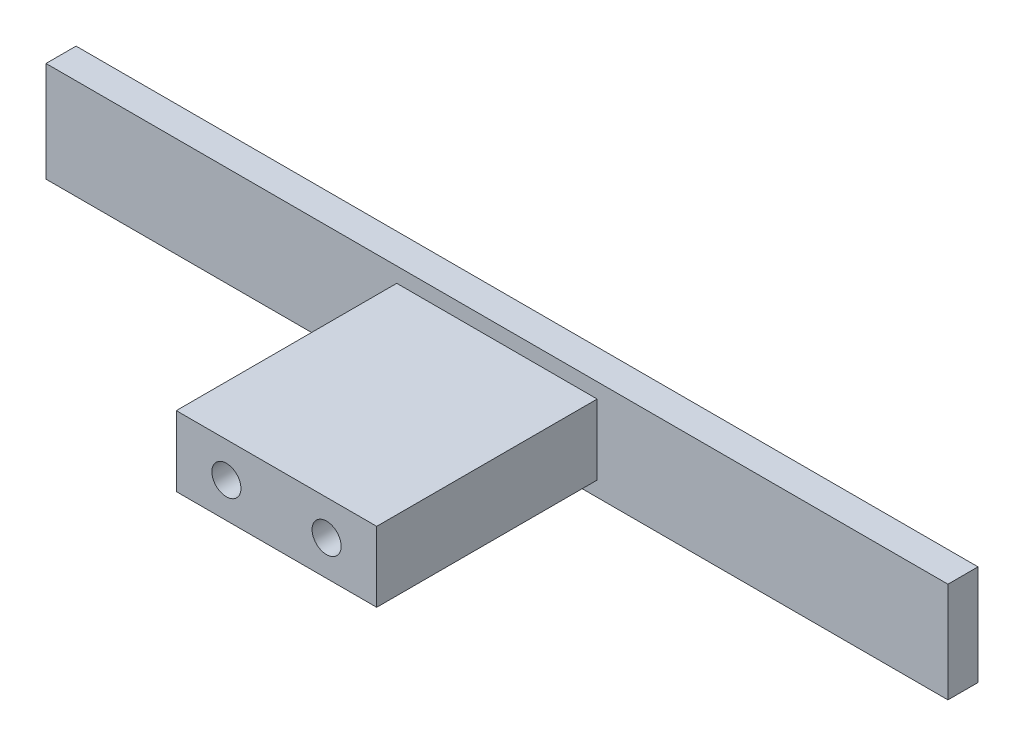
ISO-10303-21;
HEADER;
FILE_DESCRIPTION(('STEP AP214'),'2;1');
FILE_NAME('part.step','',(''),(''),'','','');
FILE_SCHEMA(('AUTOMOTIVE_DESIGN { 1 0 10303 214 1 1 1 1 }'));
ENDSEC;
DATA;
#1=APPLICATION_CONTEXT('core data for automotive mechanical design processes');
#2=APPLICATION_PROTOCOL_DEFINITION('international standard','automotive_design',2000,#1);
#3=PRODUCT_CONTEXT('',#1,'mechanical');
#4=PRODUCT('Part','Part','',(#3));
#5=PRODUCT_RELATED_PRODUCT_CATEGORY('part','',(#4));
#6=PRODUCT_DEFINITION_FORMATION('','',#4);
#7=PRODUCT_DEFINITION_CONTEXT('part definition',#1,'design');
#8=PRODUCT_DEFINITION('design','',#6,#7);
#9=PRODUCT_DEFINITION_SHAPE('','',#8);
#10=(LENGTH_UNIT() NAMED_UNIT(*) SI_UNIT(.MILLI.,.METRE.));
#11=(NAMED_UNIT(*) PLANE_ANGLE_UNIT() SI_UNIT($,.RADIAN.));
#12=(NAMED_UNIT(*) SI_UNIT($,.STERADIAN.) SOLID_ANGLE_UNIT());
#13=UNCERTAINTY_MEASURE_WITH_UNIT(LENGTH_MEASURE(1.E-05),#10,'distance_accuracy_value','');
#14=(GEOMETRIC_REPRESENTATION_CONTEXT(3) GLOBAL_UNCERTAINTY_ASSIGNED_CONTEXT((#13)) GLOBAL_UNIT_ASSIGNED_CONTEXT((#10,
#11,#12)) REPRESENTATION_CONTEXT('',''));
#15=CARTESIAN_POINT('',(0.,0.,0.));
#16=DIRECTION('',(0.,0.,1.));
#17=DIRECTION('',(1.,0.,0.));
#18=AXIS2_PLACEMENT_3D('',#15,#16,#17);
#19=CARTESIAN_POINT('',(0.,0.,3.));
#20=DIRECTION('',(1.,0.,0.));
#21=DIRECTION('',(0.,0.,-1.));
#22=AXIS2_PLACEMENT_3D('',#19,#20,#21);
#23=PLANE('',#22);
#24=DIRECTION('',(0.,-1.,0.));
#25=VECTOR('',#24,1.);
#26=CARTESIAN_POINT('',(0.,0.,0.));
#27=LINE('',#26,#25);
#28=CARTESIAN_POINT('',(0.,10.,0.));
#29=VERTEX_POINT('',#28);
#30=CARTESIAN_POINT('',(0.,0.,0.));
#31=VERTEX_POINT('',#30);
#32=EDGE_CURVE('E150',#29,#31,#27,.T.);
#33=ORIENTED_EDGE('',*,*,#32,.T.);
#34=DIRECTION('',(0.,0.,-1.));
#35=VECTOR('',#34,1.);
#36=CARTESIAN_POINT('',(0.,0.,3.));
#37=LINE('',#36,#35);
#38=CARTESIAN_POINT('',(0.,0.,3.));
#39=VERTEX_POINT('',#38);
#40=EDGE_CURVE('E11',#39,#31,#37,.T.);
#41=ORIENTED_EDGE('',*,*,#40,.F.);
#42=DIRECTION('',(0.,-1.,0.));
#43=VECTOR('',#42,1.);
#44=CARTESIAN_POINT('',(0.,0.,3.));
#45=LINE('',#44,#43);
#46=CARTESIAN_POINT('',(0.,10.,3.));
#47=VERTEX_POINT('',#46);
#48=EDGE_CURVE('E157',#47,#39,#45,.T.);
#49=ORIENTED_EDGE('',*,*,#48,.F.);
#50=DIRECTION('',(0.,0.,-1.));
#51=VECTOR('',#50,1.);
#52=CARTESIAN_POINT('',(0.,10.,3.));
#53=LINE('',#52,#51);
#54=EDGE_CURVE('E171',#47,#29,#53,.T.);
#55=ORIENTED_EDGE('',*,*,#54,.T.);
#56=EDGE_LOOP('',(#33,#41,#49,#55));
#57=FACE_BOUND('',#56,.T.);
#58=ADVANCED_FACE('F39',(#57),#23,.F.);
#59=CARTESIAN_POINT('',(0.,0.,3.));
#60=DIRECTION('',(0.,1.,0.));
#61=DIRECTION('',(0.,0.,1.));
#62=AXIS2_PLACEMENT_3D('',#59,#60,#61);
#63=PLANE('',#62);
#64=DIRECTION('',(1.,0.,0.));
#65=VECTOR('',#64,1.);
#66=CARTESIAN_POINT('',(0.,0.,0.));
#67=LINE('',#66,#65);
#68=CARTESIAN_POINT('',(90.,0.,0.));
#69=VERTEX_POINT('',#68);
#70=EDGE_CURVE('E175',#31,#69,#67,.T.);
#71=ORIENTED_EDGE('',*,*,#70,.T.);
#72=DIRECTION('',(0.,0.,-1.));
#73=VECTOR('',#72,1.);
#74=CARTESIAN_POINT('',(90.,0.,3.));
#75=LINE('',#74,#73);
#76=CARTESIAN_POINT('',(90.,0.,3.));
#77=VERTEX_POINT('',#76);
#78=EDGE_CURVE('E47',#77,#69,#75,.T.);
#79=ORIENTED_EDGE('',*,*,#78,.F.);
#80=DIRECTION('',(1.,0.,0.));
#81=VECTOR('',#80,1.);
#82=CARTESIAN_POINT('',(0.,0.,3.));
#83=LINE('',#82,#81);
#84=EDGE_CURVE('E161',#39,#77,#83,.T.);
#85=ORIENTED_EDGE('',*,*,#84,.F.);
#86=ORIENTED_EDGE('',*,*,#40,.T.);
#87=EDGE_LOOP('',(#71,#79,#85,#86));
#88=FACE_BOUND('',#87,.T.);
#89=ADVANCED_FACE('F211',(#88),#63,.F.);
#90=CARTESIAN_POINT('',(90.,0.,3.));
#91=DIRECTION('',(-1.,0.,0.));
#92=DIRECTION('',(0.,0.,1.));
#93=AXIS2_PLACEMENT_3D('',#90,#91,#92);
#94=PLANE('',#93);
#95=DIRECTION('',(0.,1.,0.));
#96=VECTOR('',#95,1.);
#97=CARTESIAN_POINT('',(90.,0.,0.));
#98=LINE('',#97,#96);
#99=CARTESIAN_POINT('',(90.,10.,0.));
#100=VERTEX_POINT('',#99);
#101=EDGE_CURVE('E178',#69,#100,#98,.T.);
#102=ORIENTED_EDGE('',*,*,#101,.T.);
#103=DIRECTION('',(0.,0.,-1.));
#104=VECTOR('',#103,1.);
#105=CARTESIAN_POINT('',(90.,10.,3.));
#106=LINE('',#105,#104);
#107=CARTESIAN_POINT('',(90.,10.,3.));
#108=VERTEX_POINT('',#107);
#109=EDGE_CURVE('E186',#108,#100,#106,.T.);
#110=ORIENTED_EDGE('',*,*,#109,.F.);
#111=DIRECTION('',(0.,1.,0.));
#112=VECTOR('',#111,1.);
#113=CARTESIAN_POINT('',(90.,0.,3.));
#114=LINE('',#113,#112);
#115=EDGE_CURVE('E165',#77,#108,#114,.T.);
#116=ORIENTED_EDGE('',*,*,#115,.F.);
#117=ORIENTED_EDGE('',*,*,#78,.T.);
#118=EDGE_LOOP('',(#102,#110,#116,#117));
#119=FACE_BOUND('',#118,.T.);
#120=ADVANCED_FACE('F195',(#119),#94,.F.);
#121=CARTESIAN_POINT('',(0.,10.,3.));
#122=DIRECTION('',(0.,-1.,0.));
#123=DIRECTION('',(0.,0.,-1.));
#124=AXIS2_PLACEMENT_3D('',#121,#122,#123);
#125=PLANE('',#124);
#126=DIRECTION('',(-1.,0.,0.));
#127=VECTOR('',#126,1.);
#128=CARTESIAN_POINT('',(0.,10.,0.));
#129=LINE('',#128,#127);
#130=EDGE_CURVE('E162',#100,#29,#129,.T.);
#131=ORIENTED_EDGE('',*,*,#130,.T.);
#132=ORIENTED_EDGE('',*,*,#54,.F.);
#133=DIRECTION('',(-1.,0.,0.));
#134=VECTOR('',#133,1.);
#135=CARTESIAN_POINT('',(0.,10.,3.));
#136=LINE('',#135,#134);
#137=EDGE_CURVE('E168',#108,#47,#136,.T.);
#138=ORIENTED_EDGE('',*,*,#137,.F.);
#139=ORIENTED_EDGE('',*,*,#109,.T.);
#140=EDGE_LOOP('',(#131,#132,#138,#139));
#141=FACE_BOUND('',#140,.T.);
#142=ADVANCED_FACE('F204',(#141),#125,.F.);
#143=CARTESIAN_POINT('',(0.,0.,3.));
#144=DIRECTION('',(0.,0.,-1.));
#145=DIRECTION('',(-1.,0.,0.));
#146=AXIS2_PLACEMENT_3D('',#143,#144,#145);
#147=PLANE('',#146);
#148=DIRECTION('',(1.,0.,0.));
#149=VECTOR('',#148,1.);
#150=CARTESIAN_POINT('',(35.,1.5,3.));
#151=LINE('',#150,#149);
#152=CARTESIAN_POINT('',(35.,1.5,3.));
#153=VERTEX_POINT('',#152);
#154=CARTESIAN_POINT('',(55.,1.5,3.));
#155=VERTEX_POINT('',#154);
#156=EDGE_CURVE('E126',#153,#155,#151,.T.);
#157=ORIENTED_EDGE('',*,*,#156,.F.);
#158=DIRECTION('',(0.,1.,0.));
#159=VECTOR('',#158,1.);
#160=CARTESIAN_POINT('',(35.,1.5,3.));
#161=LINE('',#160,#159);
#162=CARTESIAN_POINT('',(35.,8.5,3.));
#163=VERTEX_POINT('',#162);
#164=EDGE_CURVE('E54',#153,#163,#161,.T.);
#165=ORIENTED_EDGE('',*,*,#164,.T.);
#166=DIRECTION('',(1.,0.,0.));
#167=VECTOR('',#166,1.);
#168=CARTESIAN_POINT('',(35.,8.5,3.));
#169=LINE('',#168,#167);
#170=CARTESIAN_POINT('',(55.,8.5,3.));
#171=VERTEX_POINT('',#170);
#172=EDGE_CURVE('E59',#163,#171,#169,.T.);
#173=ORIENTED_EDGE('',*,*,#172,.T.);
#174=DIRECTION('',(0.,1.,0.));
#175=VECTOR('',#174,1.);
#176=CARTESIAN_POINT('',(55.,1.5,3.));
#177=LINE('',#176,#175);
#178=EDGE_CURVE('E130',#155,#171,#177,.T.);
#179=ORIENTED_EDGE('',*,*,#178,.F.);
#180=EDGE_LOOP('',(#157,#165,#173,#179));
#181=FACE_BOUND('',#180,.T.);
#182=ORIENTED_EDGE('',*,*,#48,.T.);
#183=ORIENTED_EDGE('',*,*,#84,.T.);
#184=ORIENTED_EDGE('',*,*,#115,.T.);
#185=ORIENTED_EDGE('',*,*,#137,.T.);
#186=EDGE_LOOP('',(#182,#183,#184,#185));
#187=FACE_BOUND('',#186,.T.);
#188=ADVANCED_FACE('F210',(#181,#187),#147,.F.);
#189=CARTESIAN_POINT('',(0.,0.,0.));
#190=DIRECTION('',(0.,0.,-1.));
#191=DIRECTION('',(-1.,0.,0.));
#192=AXIS2_PLACEMENT_3D('',#189,#190,#191);
#193=PLANE('',#192);
#194=ORIENTED_EDGE('',*,*,#32,.F.);
#195=ORIENTED_EDGE('',*,*,#130,.F.);
#196=ORIENTED_EDGE('',*,*,#101,.F.);
#197=ORIENTED_EDGE('',*,*,#70,.F.);
#198=EDGE_LOOP('',(#194,#195,#196,#197));
#199=FACE_BOUND('',#198,.T.);
#200=ADVANCED_FACE('F201',(#199),#193,.T.);
#201=CARTESIAN_POINT('',(35.,1.5,25.));
#202=DIRECTION('',(-1.,0.,0.));
#203=DIRECTION('',(0.,0.,1.));
#204=AXIS2_PLACEMENT_3D('',#201,#202,#203);
#205=PLANE('',#204);
#206=ORIENTED_EDGE('',*,*,#164,.F.);
#207=DIRECTION('',(0.,0.,-1.));
#208=VECTOR('',#207,1.);
#209=CARTESIAN_POINT('',(35.,1.5,25.));
#210=LINE('',#209,#208);
#211=CARTESIAN_POINT('',(35.,1.5,25.));
#212=VERTEX_POINT('',#211);
#213=EDGE_CURVE('E123',#212,#153,#210,.T.);
#214=ORIENTED_EDGE('',*,*,#213,.F.);
#215=DIRECTION('',(0.,1.,0.));
#216=VECTOR('',#215,1.);
#217=CARTESIAN_POINT('',(35.,1.5,25.));
#218=LINE('',#217,#216);
#219=CARTESIAN_POINT('',(35.,8.5,25.));
#220=VERTEX_POINT('',#219);
#221=EDGE_CURVE('E115',#212,#220,#218,.T.);
#222=ORIENTED_EDGE('',*,*,#221,.T.);
#223=DIRECTION('',(0.,0.,-1.));
#224=VECTOR('',#223,1.);
#225=CARTESIAN_POINT('',(35.,8.5,25.));
#226=LINE('',#225,#224);
#227=EDGE_CURVE('E102',#220,#163,#226,.T.);
#228=ORIENTED_EDGE('',*,*,#227,.T.);
#229=EDGE_LOOP('',(#206,#214,#222,#228));
#230=FACE_BOUND('',#229,.T.);
#231=ADVANCED_FACE('F121',(#230),#205,.T.);
#232=CARTESIAN_POINT('',(35.,1.5,25.));
#233=DIRECTION('',(0.,1.,0.));
#234=DIRECTION('',(0.,0.,1.));
#235=AXIS2_PLACEMENT_3D('',#232,#233,#234);
#236=PLANE('',#235);
#237=ORIENTED_EDGE('',*,*,#156,.T.);
#238=DIRECTION('',(0.,0.,-1.));
#239=VECTOR('',#238,1.);
#240=CARTESIAN_POINT('',(55.,1.5,25.));
#241=LINE('',#240,#239);
#242=CARTESIAN_POINT('',(55.,1.5,25.));
#243=VERTEX_POINT('',#242);
#244=EDGE_CURVE('E151',#243,#155,#241,.T.);
#245=ORIENTED_EDGE('',*,*,#244,.F.);
#246=DIRECTION('',(1.,0.,0.));
#247=VECTOR('',#246,1.);
#248=CARTESIAN_POINT('',(35.,1.5,25.));
#249=LINE('',#248,#247);
#250=EDGE_CURVE('E110',#212,#243,#249,.T.);
#251=ORIENTED_EDGE('',*,*,#250,.F.);
#252=ORIENTED_EDGE('',*,*,#213,.T.);
#253=EDGE_LOOP('',(#237,#245,#251,#252));
#254=FACE_BOUND('',#253,.T.);
#255=ADVANCED_FACE('F227',(#254),#236,.F.);
#256=CARTESIAN_POINT('',(55.,1.5,25.));
#257=DIRECTION('',(-1.,0.,0.));
#258=DIRECTION('',(0.,0.,1.));
#259=AXIS2_PLACEMENT_3D('',#256,#257,#258);
#260=PLANE('',#259);
#261=ORIENTED_EDGE('',*,*,#178,.T.);
#262=DIRECTION('',(0.,0.,-1.));
#263=VECTOR('',#262,1.);
#264=CARTESIAN_POINT('',(55.,8.5,25.));
#265=LINE('',#264,#263);
#266=CARTESIAN_POINT('',(55.,8.5,25.));
#267=VERTEX_POINT('',#266);
#268=EDGE_CURVE('E109',#267,#171,#265,.T.);
#269=ORIENTED_EDGE('',*,*,#268,.F.);
#270=DIRECTION('',(0.,1.,0.));
#271=VECTOR('',#270,1.);
#272=CARTESIAN_POINT('',(55.,1.5,25.));
#273=LINE('',#272,#271);
#274=EDGE_CURVE('E117',#243,#267,#273,.T.);
#275=ORIENTED_EDGE('',*,*,#274,.F.);
#276=ORIENTED_EDGE('',*,*,#244,.T.);
#277=EDGE_LOOP('',(#261,#269,#275,#276));
#278=FACE_BOUND('',#277,.T.);
#279=ADVANCED_FACE('F230',(#278),#260,.F.);
#280=CARTESIAN_POINT('',(35.,8.5,25.));
#281=DIRECTION('',(0.,1.,0.));
#282=DIRECTION('',(0.,0.,1.));
#283=AXIS2_PLACEMENT_3D('',#280,#281,#282);
#284=PLANE('',#283);
#285=ORIENTED_EDGE('',*,*,#172,.F.);
#286=ORIENTED_EDGE('',*,*,#227,.F.);
#287=DIRECTION('',(1.,0.,0.));
#288=VECTOR('',#287,1.);
#289=CARTESIAN_POINT('',(35.,8.5,25.));
#290=LINE('',#289,#288);
#291=EDGE_CURVE('E105',#220,#267,#290,.T.);
#292=ORIENTED_EDGE('',*,*,#291,.T.);
#293=ORIENTED_EDGE('',*,*,#268,.T.);
#294=EDGE_LOOP('',(#285,#286,#292,#293));
#295=FACE_BOUND('',#294,.T.);
#296=ADVANCED_FACE('F104',(#295),#284,.T.);
#297=CARTESIAN_POINT('',(0.,0.,25.));
#298=DIRECTION('',(0.,0.,-1.));
#299=DIRECTION('',(-1.,0.,0.));
#300=AXIS2_PLACEMENT_3D('',#297,#298,#299);
#301=PLANE('',#300);
#302=CARTESIAN_POINT('',(50.,5.,25.));
#303=DIRECTION('',(0.,0.,1.));
#304=DIRECTION('',(1.,0.,0.));
#305=AXIS2_PLACEMENT_3D('',#302,#303,#304);
#306=CIRCLE('',#305,1.45);
#307=CARTESIAN_POINT('',(51.45,5.,25.));
#308=VERTEX_POINT('',#307);
#309=EDGE_CURVE('E260',#308,#308,#306,.T.);
#310=ORIENTED_EDGE('',*,*,#309,.F.);
#311=EDGE_LOOP('',(#310));
#312=FACE_BOUND('',#311,.T.);
#313=CARTESIAN_POINT('',(40.,5.,25.));
#314=DIRECTION('',(0.,0.,1.));
#315=DIRECTION('',(1.,0.,0.));
#316=AXIS2_PLACEMENT_3D('',#313,#314,#315);
#317=CIRCLE('',#316,1.45);
#318=CARTESIAN_POINT('',(41.45,5.,25.));
#319=VERTEX_POINT('',#318);
#320=EDGE_CURVE('E133',#319,#319,#317,.T.);
#321=ORIENTED_EDGE('',*,*,#320,.F.);
#322=EDGE_LOOP('',(#321));
#323=FACE_BOUND('',#322,.T.);
#324=ORIENTED_EDGE('',*,*,#221,.F.);
#325=ORIENTED_EDGE('',*,*,#250,.T.);
#326=ORIENTED_EDGE('',*,*,#274,.T.);
#327=ORIENTED_EDGE('',*,*,#291,.F.);
#328=EDGE_LOOP('',(#324,#325,#326,#327));
#329=FACE_BOUND('',#328,.T.);
#330=ADVANCED_FACE('F114',(#312,#323,#329),#301,.F.);
#331=CARTESIAN_POINT('',(40.,5.,16.));
#332=DIRECTION('',(0.,0.,1.));
#333=DIRECTION('',(1.,0.,0.));
#334=AXIS2_PLACEMENT_3D('',#331,#332,#333);
#335=CYLINDRICAL_SURFACE('',#334,1.45);
#336=CARTESIAN_POINT('',(40.,5.,16.));
#337=DIRECTION('',(0.,0.,1.));
#338=DIRECTION('',(1.,0.,0.));
#339=AXIS2_PLACEMENT_3D('',#336,#337,#338);
#340=CIRCLE('',#339,1.45);
#341=CARTESIAN_POINT('',(41.45,5.,16.));
#342=VERTEX_POINT('',#341);
#343=EDGE_CURVE('E264',#342,#342,#340,.T.);
#344=ORIENTED_EDGE('',*,*,#343,.F.);
#345=EDGE_LOOP('',(#344));
#346=FACE_BOUND('',#345,.T.);
#347=ORIENTED_EDGE('',*,*,#320,.T.);
#348=EDGE_LOOP('',(#347));
#349=FACE_BOUND('',#348,.T.);
#350=ADVANCED_FACE('F239',(#346,#349),#335,.F.);
#351=CARTESIAN_POINT('',(0.,0.,16.));
#352=DIRECTION('',(0.,0.,1.));
#353=DIRECTION('',(1.,0.,0.));
#354=AXIS2_PLACEMENT_3D('',#351,#352,#353);
#355=PLANE('',#354);
#356=ORIENTED_EDGE('',*,*,#343,.T.);
#357=EDGE_LOOP('',(#356));
#358=FACE_BOUND('',#357,.T.);
#359=ADVANCED_FACE('F243',(#358),#355,.T.);
#360=CARTESIAN_POINT('',(50.,5.,16.));
#361=DIRECTION('',(0.,0.,1.));
#362=DIRECTION('',(1.,0.,0.));
#363=AXIS2_PLACEMENT_3D('',#360,#361,#362);
#364=CYLINDRICAL_SURFACE('',#363,1.45);
#365=CARTESIAN_POINT('',(50.,5.,16.));
#366=DIRECTION('',(0.,0.,1.));
#367=DIRECTION('',(1.,0.,0.));
#368=AXIS2_PLACEMENT_3D('',#365,#366,#367);
#369=CIRCLE('',#368,1.45);
#370=CARTESIAN_POINT('',(51.45,5.,16.));
#371=VERTEX_POINT('',#370);
#372=EDGE_CURVE('E142',#371,#371,#369,.T.);
#373=ORIENTED_EDGE('',*,*,#372,.F.);
#374=EDGE_LOOP('',(#373));
#375=FACE_BOUND('',#374,.T.);
#376=ORIENTED_EDGE('',*,*,#309,.T.);
#377=EDGE_LOOP('',(#376));
#378=FACE_BOUND('',#377,.T.);
#379=ADVANCED_FACE('F247',(#375,#378),#364,.F.);
#380=CARTESIAN_POINT('',(0.,0.,16.));
#381=DIRECTION('',(0.,0.,1.));
#382=DIRECTION('',(1.,0.,0.));
#383=AXIS2_PLACEMENT_3D('',#380,#381,#382);
#384=PLANE('',#383);
#385=ORIENTED_EDGE('',*,*,#372,.T.);
#386=EDGE_LOOP('',(#385));
#387=FACE_BOUND('',#386,.T.);
#388=ADVANCED_FACE('F251',(#387),#384,.T.);
#389=CLOSED_SHELL('',(#58,#89,#120,#142,#188,#200,#231,#255,#279,#296,#330,#350,#359,#379,#388));
#390=MANIFOLD_SOLID_BREP('B2',#389);
#391=ADVANCED_BREP_SHAPE_REPRESENTATION('',(#18,#390),#14);
#392=SHAPE_DEFINITION_REPRESENTATION(#9,#391);
ENDSEC;
END-ISO-10303-21;
